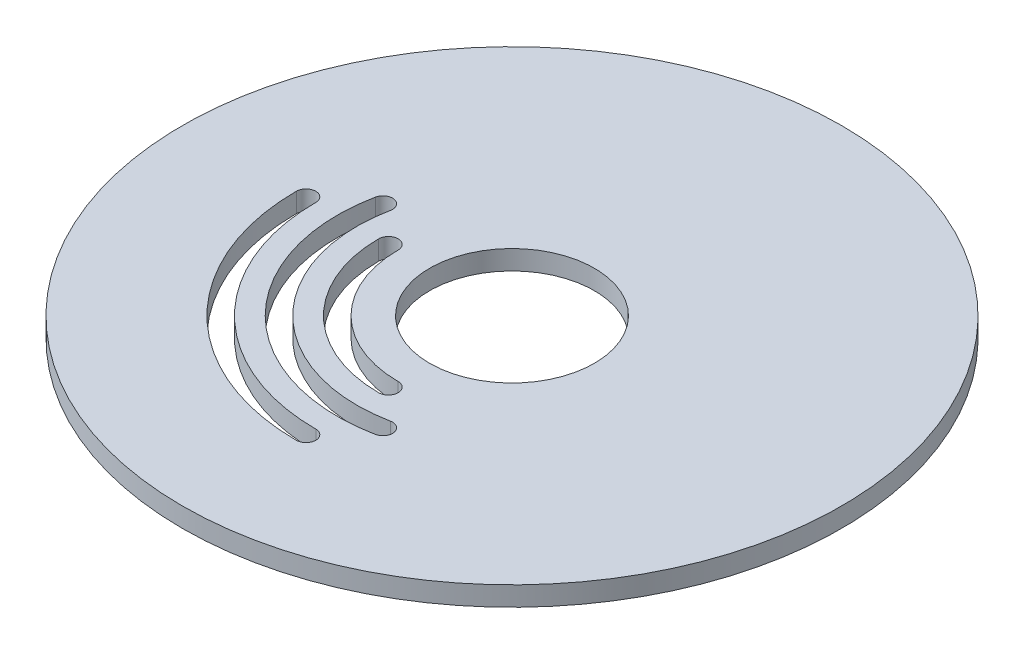
ISO-10303-21;
HEADER;
FILE_DESCRIPTION(('STEP AP214'),'2;1');
FILE_NAME('part.step','',(''),(''),'','','');
FILE_SCHEMA(('AUTOMOTIVE_DESIGN { 1 0 10303 214 1 1 1 1 }'));
ENDSEC;
DATA;
#1=APPLICATION_CONTEXT('core data for automotive mechanical design processes');
#2=APPLICATION_PROTOCOL_DEFINITION('international standard','automotive_design',2000,#1);
#3=PRODUCT_CONTEXT('',#1,'mechanical');
#4=PRODUCT('Part','Part','',(#3));
#5=PRODUCT_RELATED_PRODUCT_CATEGORY('part','',(#4));
#6=PRODUCT_DEFINITION_FORMATION('','',#4);
#7=PRODUCT_DEFINITION_CONTEXT('part definition',#1,'design');
#8=PRODUCT_DEFINITION('design','',#6,#7);
#9=PRODUCT_DEFINITION_SHAPE('','',#8);
#10=(LENGTH_UNIT() NAMED_UNIT(*) SI_UNIT(.MILLI.,.METRE.));
#11=(NAMED_UNIT(*) PLANE_ANGLE_UNIT() SI_UNIT($,.RADIAN.));
#12=(NAMED_UNIT(*) SI_UNIT($,.STERADIAN.) SOLID_ANGLE_UNIT());
#13=UNCERTAINTY_MEASURE_WITH_UNIT(LENGTH_MEASURE(1.E-05),#10,'distance_accuracy_value','');
#14=(GEOMETRIC_REPRESENTATION_CONTEXT(3) GLOBAL_UNCERTAINTY_ASSIGNED_CONTEXT((#13)) GLOBAL_UNIT_ASSIGNED_CONTEXT((#10,
#11,#12)) REPRESENTATION_CONTEXT('',''));
#15=CARTESIAN_POINT('',(0.,0.,0.));
#16=DIRECTION('',(0.,0.,1.));
#17=DIRECTION('',(1.,0.,0.));
#18=AXIS2_PLACEMENT_3D('',#15,#16,#17);
#19=CARTESIAN_POINT('',(0.,3.,0.));
#20=DIRECTION('',(0.,1.,0.));
#21=DIRECTION('',(0.,0.,1.));
#22=AXIS2_PLACEMENT_3D('',#19,#20,#21);
#23=PLANE('',#22);
#24=CARTESIAN_POINT('',(0.,3.,0.));
#25=DIRECTION('',(0.,1.,0.));
#26=DIRECTION('',(0.,0.,1.));
#27=AXIS2_PLACEMENT_3D('',#24,#25,#26);
#28=CIRCLE('',#27,50.8);
#29=CARTESIAN_POINT('',(0.,3.,50.8));
#30=VERTEX_POINT('',#29);
#31=EDGE_CURVE('E11',#30,#30,#28,.T.);
#32=ORIENTED_EDGE('',*,*,#31,.T.);
#33=EDGE_LOOP('',(#32));
#34=FACE_BOUND('',#33,.T.);
#35=CARTESIAN_POINT('',(0.,3.,0.));
#36=DIRECTION('',(0.,1.,0.));
#37=DIRECTION('',(0.,0.,1.));
#38=AXIS2_PLACEMENT_3D('',#35,#36,#37);
#39=CIRCLE('',#38,12.7);
#40=CARTESIAN_POINT('',(0.,3.,12.7));
#41=VERTEX_POINT('',#40);
#42=EDGE_CURVE('E269',#41,#41,#39,.T.);
#43=ORIENTED_EDGE('',*,*,#42,.F.);
#44=EDGE_LOOP('',(#43));
#45=FACE_BOUND('',#44,.T.);
#46=CARTESIAN_POINT('',(0.,3.,0.));
#47=DIRECTION('',(0.,1.,0.));
#48=DIRECTION('',(0.,0.,1.));
#49=AXIS2_PLACEMENT_3D('',#46,#47,#48);
#50=CIRCLE('',#49,33.25);
#51=CARTESIAN_POINT('',(-33.25,3.,0.));
#52=VERTEX_POINT('',#51);
#53=CARTESIAN_POINT('',(0.,3.,33.25));
#54=VERTEX_POINT('',#53);
#55=EDGE_CURVE('E229',#52,#54,#50,.T.);
#56=ORIENTED_EDGE('',*,*,#55,.F.);
#57=CARTESIAN_POINT('',(-31.75,3.,0.));
#58=DIRECTION('',(0.,1.,0.));
#59=DIRECTION('',(0.,0.,1.));
#60=AXIS2_PLACEMENT_3D('',#57,#58,#59);
#61=CIRCLE('',#60,1.5);
#62=CARTESIAN_POINT('',(-30.25,3.,0.));
#63=VERTEX_POINT('',#62);
#64=EDGE_CURVE('E226',#63,#52,#61,.T.);
#65=ORIENTED_EDGE('',*,*,#64,.F.);
#66=CARTESIAN_POINT('',(0.,3.,0.));
#67=DIRECTION('',(0.,-1.,0.));
#68=DIRECTION('',(0.,0.,1.));
#69=AXIS2_PLACEMENT_3D('',#66,#67,#68);
#70=CIRCLE('',#69,30.25);
#71=CARTESIAN_POINT('',(0.,3.,30.25));
#72=VERTEX_POINT('',#71);
#73=EDGE_CURVE('E237',#72,#63,#70,.T.);
#74=ORIENTED_EDGE('',*,*,#73,.F.);
#75=CARTESIAN_POINT('',(0.,3.,31.75));
#76=DIRECTION('',(0.,1.,0.));
#77=DIRECTION('',(0.,0.,1.));
#78=AXIS2_PLACEMENT_3D('',#75,#76,#77);
#79=CIRCLE('',#78,1.5);
#80=EDGE_CURVE('E233',#54,#72,#79,.T.);
#81=ORIENTED_EDGE('',*,*,#80,.F.);
#82=EDGE_LOOP('',(#56,#65,#74,#81));
#83=FACE_BOUND('',#82,.T.);
#84=CARTESIAN_POINT('',(0.,3.,0.));
#85=DIRECTION('',(0.,1.,0.));
#86=DIRECTION('',(0.,0.,1.));
#87=AXIS2_PLACEMENT_3D('',#84,#85,#86);
#88=CIRCLE('',#87,26.9);
#89=CARTESIAN_POINT('',(-26.3736621730869,3.,-5.29527559055118));
#90=VERTEX_POINT('',#89);
#91=CARTESIAN_POINT('',(5.29527559055117,3.,26.3736621730869));
#92=VERTEX_POINT('',#91);
#93=EDGE_CURVE('E186',#90,#92,#88,.T.);
#94=ORIENTED_EDGE('',*,*,#93,.F.);
#95=CARTESIAN_POINT('',(-24.9030118660374,3.,-5.));
#96=DIRECTION('',(0.,1.,0.));
#97=DIRECTION('',(0.,0.,1.));
#98=AXIS2_PLACEMENT_3D('',#95,#96,#97);
#99=CIRCLE('',#98,1.5);
#100=CARTESIAN_POINT('',(-23.432361558988,3.,-4.70472440944882));
#101=VERTEX_POINT('',#100);
#102=EDGE_CURVE('E183',#101,#90,#99,.T.);
#103=ORIENTED_EDGE('',*,*,#102,.F.);
#104=CARTESIAN_POINT('',(0.,3.,0.));
#105=DIRECTION('',(0.,-1.,0.));
#106=DIRECTION('',(0.,0.,1.));
#107=AXIS2_PLACEMENT_3D('',#104,#105,#106);
#108=CIRCLE('',#107,23.9);
#109=CARTESIAN_POINT('',(4.70472440944881,3.,23.432361558988));
#110=VERTEX_POINT('',#109);
#111=EDGE_CURVE('E194',#110,#101,#108,.T.);
#112=ORIENTED_EDGE('',*,*,#111,.F.);
#113=CARTESIAN_POINT('',(5.,3.,24.9030118660374));
#114=DIRECTION('',(0.,1.,0.));
#115=DIRECTION('',(0.,0.,1.));
#116=AXIS2_PLACEMENT_3D('',#113,#114,#115);
#117=CIRCLE('',#116,1.5);
#118=EDGE_CURVE('E190',#92,#110,#117,.T.);
#119=ORIENTED_EDGE('',*,*,#118,.F.);
#120=EDGE_LOOP('',(#94,#103,#112,#119));
#121=FACE_BOUND('',#120,.T.);
#122=CARTESIAN_POINT('',(0.,3.,0.));
#123=DIRECTION('',(0.,1.,0.));
#124=DIRECTION('',(0.,0.,1.));
#125=AXIS2_PLACEMENT_3D('',#122,#123,#124);
#126=CIRCLE('',#125,20.55);
#127=CARTESIAN_POINT('',(-20.55,3.,0.));
#128=VERTEX_POINT('',#127);
#129=CARTESIAN_POINT('',(0.,3.,20.55));
#130=VERTEX_POINT('',#129);
#131=EDGE_CURVE('E144',#128,#130,#126,.T.);
#132=ORIENTED_EDGE('',*,*,#131,.F.);
#133=CARTESIAN_POINT('',(-19.05,3.,0.));
#134=DIRECTION('',(0.,1.,0.));
#135=DIRECTION('',(0.,0.,1.));
#136=AXIS2_PLACEMENT_3D('',#133,#134,#135);
#137=CIRCLE('',#136,1.5);
#138=CARTESIAN_POINT('',(-17.55,3.,0.));
#139=VERTEX_POINT('',#138);
#140=EDGE_CURVE('E135',#139,#128,#137,.T.);
#141=ORIENTED_EDGE('',*,*,#140,.F.);
#142=CARTESIAN_POINT('',(0.,3.,0.));
#143=DIRECTION('',(0.,-1.,0.));
#144=DIRECTION('',(0.,0.,1.));
#145=AXIS2_PLACEMENT_3D('',#142,#143,#144);
#146=CIRCLE('',#145,17.55);
#147=CARTESIAN_POINT('',(0.,3.,17.55));
#148=VERTEX_POINT('',#147);
#149=EDGE_CURVE('E161',#148,#139,#146,.T.);
#150=ORIENTED_EDGE('',*,*,#149,.F.);
#151=CARTESIAN_POINT('',(0.,3.,19.05));
#152=DIRECTION('',(0.,1.,0.));
#153=DIRECTION('',(0.,0.,1.));
#154=AXIS2_PLACEMENT_3D('',#151,#152,#153);
#155=CIRCLE('',#154,1.5);
#156=EDGE_CURVE('E157',#130,#148,#155,.T.);
#157=ORIENTED_EDGE('',*,*,#156,.F.);
#158=EDGE_LOOP('',(#132,#141,#150,#157));
#159=FACE_BOUND('',#158,.T.);
#160=ADVANCED_FACE('F45',(#34,#45,#83,#121,#159),#23,.T.);
#161=CARTESIAN_POINT('',(0.,0.,0.));
#162=DIRECTION('',(0.,1.,0.));
#163=DIRECTION('',(0.,0.,1.));
#164=AXIS2_PLACEMENT_3D('',#161,#162,#163);
#165=PLANE('',#164);
#166=CARTESIAN_POINT('',(-24.9030118660374,0.,-5.));
#167=DIRECTION('',(0.,1.,0.));
#168=DIRECTION('',(0.,0.,1.));
#169=AXIS2_PLACEMENT_3D('',#166,#167,#168);
#170=CIRCLE('',#169,1.5);
#171=CARTESIAN_POINT('',(-23.432361558988,0.,-4.70472440944882));
#172=VERTEX_POINT('',#171);
#173=CARTESIAN_POINT('',(-26.3736621730869,0.,-5.29527559055118));
#174=VERTEX_POINT('',#173);
#175=EDGE_CURVE('E153',#172,#174,#170,.T.);
#176=ORIENTED_EDGE('',*,*,#175,.T.);
#177=CARTESIAN_POINT('',(0.,0.,0.));
#178=DIRECTION('',(0.,1.,0.));
#179=DIRECTION('',(0.,0.,1.));
#180=AXIS2_PLACEMENT_3D('',#177,#178,#179);
#181=CIRCLE('',#180,26.9);
#182=CARTESIAN_POINT('',(5.29527559055117,0.,26.3736621730869));
#183=VERTEX_POINT('',#182);
#184=EDGE_CURVE('E201',#174,#183,#181,.T.);
#185=ORIENTED_EDGE('',*,*,#184,.T.);
#186=CARTESIAN_POINT('',(5.,0.,24.9030118660374));
#187=DIRECTION('',(0.,1.,0.));
#188=DIRECTION('',(0.,0.,1.));
#189=AXIS2_PLACEMENT_3D('',#186,#187,#188);
#190=CIRCLE('',#189,1.5);
#191=CARTESIAN_POINT('',(4.70472440944881,0.,23.432361558988));
#192=VERTEX_POINT('',#191);
#193=EDGE_CURVE('E205',#183,#192,#190,.T.);
#194=ORIENTED_EDGE('',*,*,#193,.T.);
#195=CARTESIAN_POINT('',(0.,0.,0.));
#196=DIRECTION('',(0.,-1.,0.));
#197=DIRECTION('',(0.,0.,1.));
#198=AXIS2_PLACEMENT_3D('',#195,#196,#197);
#199=CIRCLE('',#198,23.9);
#200=EDGE_CURVE('E187',#192,#172,#199,.T.);
#201=ORIENTED_EDGE('',*,*,#200,.T.);
#202=EDGE_LOOP('',(#176,#185,#194,#201));
#203=FACE_BOUND('',#202,.T.);
#204=CARTESIAN_POINT('',(0.,0.,0.));
#205=DIRECTION('',(0.,1.,0.));
#206=DIRECTION('',(0.,0.,1.));
#207=AXIS2_PLACEMENT_3D('',#204,#205,#206);
#208=CIRCLE('',#207,12.7);
#209=CARTESIAN_POINT('',(0.,0.,12.7));
#210=VERTEX_POINT('',#209);
#211=EDGE_CURVE('E268',#210,#210,#208,.T.);
#212=ORIENTED_EDGE('',*,*,#211,.T.);
#213=EDGE_LOOP('',(#212));
#214=FACE_BOUND('',#213,.T.);
#215=CARTESIAN_POINT('',(0.,0.,0.));
#216=DIRECTION('',(0.,1.,0.));
#217=DIRECTION('',(0.,0.,1.));
#218=AXIS2_PLACEMENT_3D('',#215,#216,#217);
#219=CIRCLE('',#218,50.8);
#220=CARTESIAN_POINT('',(0.,0.,50.8));
#221=VERTEX_POINT('',#220);
#222=EDGE_CURVE('E49',#221,#221,#219,.T.);
#223=ORIENTED_EDGE('',*,*,#222,.F.);
#224=EDGE_LOOP('',(#223));
#225=FACE_BOUND('',#224,.T.);
#226=CARTESIAN_POINT('',(-31.75,0.,0.));
#227=DIRECTION('',(0.,1.,0.));
#228=DIRECTION('',(0.,0.,1.));
#229=AXIS2_PLACEMENT_3D('',#226,#227,#228);
#230=CIRCLE('',#229,1.5);
#231=CARTESIAN_POINT('',(-30.25,0.,0.));
#232=VERTEX_POINT('',#231);
#233=CARTESIAN_POINT('',(-33.25,0.,0.));
#234=VERTEX_POINT('',#233);
#235=EDGE_CURVE('E225',#232,#234,#230,.T.);
#236=ORIENTED_EDGE('',*,*,#235,.T.);
#237=CARTESIAN_POINT('',(0.,0.,0.));
#238=DIRECTION('',(0.,1.,0.));
#239=DIRECTION('',(0.,0.,1.));
#240=AXIS2_PLACEMENT_3D('',#237,#238,#239);
#241=CIRCLE('',#240,33.25);
#242=CARTESIAN_POINT('',(0.,0.,33.25));
#243=VERTEX_POINT('',#242);
#244=EDGE_CURVE('E244',#234,#243,#241,.T.);
#245=ORIENTED_EDGE('',*,*,#244,.T.);
#246=CARTESIAN_POINT('',(0.,0.,31.75));
#247=DIRECTION('',(0.,1.,0.));
#248=DIRECTION('',(0.,0.,1.));
#249=AXIS2_PLACEMENT_3D('',#246,#247,#248);
#250=CIRCLE('',#249,1.5);
#251=CARTESIAN_POINT('',(0.,0.,30.25));
#252=VERTEX_POINT('',#251);
#253=EDGE_CURVE('E248',#243,#252,#250,.T.);
#254=ORIENTED_EDGE('',*,*,#253,.T.);
#255=CARTESIAN_POINT('',(0.,0.,0.));
#256=DIRECTION('',(0.,-1.,0.));
#257=DIRECTION('',(0.,0.,1.));
#258=AXIS2_PLACEMENT_3D('',#255,#256,#257);
#259=CIRCLE('',#258,30.25);
#260=EDGE_CURVE('E230',#252,#232,#259,.T.);
#261=ORIENTED_EDGE('',*,*,#260,.T.);
#262=EDGE_LOOP('',(#236,#245,#254,#261));
#263=FACE_BOUND('',#262,.T.);
#264=CARTESIAN_POINT('',(-19.05,0.,0.));
#265=DIRECTION('',(0.,1.,0.));
#266=DIRECTION('',(0.,0.,1.));
#267=AXIS2_PLACEMENT_3D('',#264,#265,#266);
#268=CIRCLE('',#267,1.5);
#269=CARTESIAN_POINT('',(-17.55,0.,0.));
#270=VERTEX_POINT('',#269);
#271=CARTESIAN_POINT('',(-20.55,0.,0.));
#272=VERTEX_POINT('',#271);
#273=EDGE_CURVE('E69',#270,#272,#268,.T.);
#274=ORIENTED_EDGE('',*,*,#273,.T.);
#275=CARTESIAN_POINT('',(0.,0.,0.));
#276=DIRECTION('',(0.,1.,0.));
#277=DIRECTION('',(0.,0.,1.));
#278=AXIS2_PLACEMENT_3D('',#275,#276,#277);
#279=CIRCLE('',#278,20.55);
#280=CARTESIAN_POINT('',(0.,0.,20.55));
#281=VERTEX_POINT('',#280);
#282=EDGE_CURVE('E151',#272,#281,#279,.T.);
#283=ORIENTED_EDGE('',*,*,#282,.T.);
#284=CARTESIAN_POINT('',(0.,0.,19.05));
#285=DIRECTION('',(0.,1.,0.));
#286=DIRECTION('',(0.,0.,1.));
#287=AXIS2_PLACEMENT_3D('',#284,#285,#286);
#288=CIRCLE('',#287,1.5);
#289=CARTESIAN_POINT('',(0.,0.,17.55));
#290=VERTEX_POINT('',#289);
#291=EDGE_CURVE('E170',#281,#290,#288,.T.);
#292=ORIENTED_EDGE('',*,*,#291,.T.);
#293=CARTESIAN_POINT('',(0.,0.,0.));
#294=DIRECTION('',(0.,-1.,0.));
#295=DIRECTION('',(0.,0.,1.));
#296=AXIS2_PLACEMENT_3D('',#293,#294,#295);
#297=CIRCLE('',#296,17.55);
#298=EDGE_CURVE('E145',#290,#270,#297,.T.);
#299=ORIENTED_EDGE('',*,*,#298,.T.);
#300=EDGE_LOOP('',(#274,#283,#292,#299));
#301=FACE_BOUND('',#300,.T.);
#302=ADVANCED_FACE('F277',(#203,#214,#225,#263,#301),#165,.F.);
#303=CARTESIAN_POINT('',(0.,3.,0.));
#304=DIRECTION('',(0.,-1.,0.));
#305=DIRECTION('',(0.,0.,-1.));
#306=AXIS2_PLACEMENT_3D('',#303,#304,#305);
#307=CYLINDRICAL_SURFACE('',#306,50.8);
#308=ORIENTED_EDGE('',*,*,#31,.F.);
#309=EDGE_LOOP('',(#308));
#310=FACE_BOUND('',#309,.T.);
#311=ORIENTED_EDGE('',*,*,#222,.T.);
#312=EDGE_LOOP('',(#311));
#313=FACE_BOUND('',#312,.T.);
#314=ADVANCED_FACE('F47',(#310,#313),#307,.T.);
#315=CARTESIAN_POINT('',(0.,3.,0.));
#316=DIRECTION('',(0.,-1.,0.));
#317=DIRECTION('',(0.,0.,-1.));
#318=AXIS2_PLACEMENT_3D('',#315,#316,#317);
#319=CYLINDRICAL_SURFACE('',#318,12.7);
#320=ORIENTED_EDGE('',*,*,#42,.T.);
#321=EDGE_LOOP('',(#320));
#322=FACE_BOUND('',#321,.T.);
#323=ORIENTED_EDGE('',*,*,#211,.F.);
#324=EDGE_LOOP('',(#323));
#325=FACE_BOUND('',#324,.T.);
#326=ADVANCED_FACE('F280',(#322,#325),#319,.F.);
#327=CARTESIAN_POINT('',(-31.75,3.,0.));
#328=DIRECTION('',(0.,-1.,0.));
#329=DIRECTION('',(0.,0.,-1.));
#330=AXIS2_PLACEMENT_3D('',#327,#328,#329);
#331=CYLINDRICAL_SURFACE('',#330,1.5);
#332=ORIENTED_EDGE('',*,*,#235,.F.);
#333=DIRECTION('',(0.,-1.,0.));
#334=VECTOR('',#333,1.);
#335=CARTESIAN_POINT('',(-30.25,3.,0.));
#336=LINE('',#335,#334);
#337=EDGE_CURVE('E240',#63,#232,#336,.T.);
#338=ORIENTED_EDGE('',*,*,#337,.F.);
#339=ORIENTED_EDGE('',*,*,#64,.T.);
#340=DIRECTION('',(0.,-1.,0.));
#341=VECTOR('',#340,1.);
#342=CARTESIAN_POINT('',(-33.25,3.,0.));
#343=LINE('',#342,#341);
#344=EDGE_CURVE('E264',#52,#234,#343,.T.);
#345=ORIENTED_EDGE('',*,*,#344,.T.);
#346=EDGE_LOOP('',(#332,#338,#339,#345));
#347=FACE_BOUND('',#346,.T.);
#348=ADVANCED_FACE('F282',(#347),#331,.F.);
#349=CARTESIAN_POINT('',(0.,3.,0.));
#350=DIRECTION('',(0.,-1.,0.));
#351=DIRECTION('',(0.,0.,-1.));
#352=AXIS2_PLACEMENT_3D('',#349,#350,#351);
#353=CYLINDRICAL_SURFACE('',#352,33.25);
#354=ORIENTED_EDGE('',*,*,#244,.F.);
#355=ORIENTED_EDGE('',*,*,#344,.F.);
#356=ORIENTED_EDGE('',*,*,#55,.T.);
#357=DIRECTION('',(0.,-1.,0.));
#358=VECTOR('',#357,1.);
#359=CARTESIAN_POINT('',(0.,3.,33.25));
#360=LINE('',#359,#358);
#361=EDGE_CURVE('E261',#54,#243,#360,.T.);
#362=ORIENTED_EDGE('',*,*,#361,.T.);
#363=EDGE_LOOP('',(#354,#355,#356,#362));
#364=FACE_BOUND('',#363,.T.);
#365=ADVANCED_FACE('F289',(#364),#353,.F.);
#366=CARTESIAN_POINT('',(0.,3.,31.75));
#367=DIRECTION('',(0.,-1.,0.));
#368=DIRECTION('',(0.,0.,-1.));
#369=AXIS2_PLACEMENT_3D('',#366,#367,#368);
#370=CYLINDRICAL_SURFACE('',#369,1.5);
#371=ORIENTED_EDGE('',*,*,#253,.F.);
#372=ORIENTED_EDGE('',*,*,#361,.F.);
#373=ORIENTED_EDGE('',*,*,#80,.T.);
#374=DIRECTION('',(0.,-1.,0.));
#375=VECTOR('',#374,1.);
#376=CARTESIAN_POINT('',(0.,3.,30.25));
#377=LINE('',#376,#375);
#378=EDGE_CURVE('E258',#72,#252,#377,.T.);
#379=ORIENTED_EDGE('',*,*,#378,.T.);
#380=EDGE_LOOP('',(#371,#372,#373,#379));
#381=FACE_BOUND('',#380,.T.);
#382=ADVANCED_FACE('F342',(#381),#370,.F.);
#383=CARTESIAN_POINT('',(0.,3.,0.));
#384=DIRECTION('',(0.,-1.,0.));
#385=DIRECTION('',(0.,0.,-1.));
#386=AXIS2_PLACEMENT_3D('',#383,#384,#385);
#387=CYLINDRICAL_SURFACE('',#386,30.25);
#388=ORIENTED_EDGE('',*,*,#260,.F.);
#389=ORIENTED_EDGE('',*,*,#378,.F.);
#390=ORIENTED_EDGE('',*,*,#73,.T.);
#391=ORIENTED_EDGE('',*,*,#337,.T.);
#392=EDGE_LOOP('',(#388,#389,#390,#391));
#393=FACE_BOUND('',#392,.T.);
#394=ADVANCED_FACE('F339',(#393),#387,.T.);
#395=CARTESIAN_POINT('',(-24.9030118660374,3.,-5.));
#396=DIRECTION('',(0.,-1.,0.));
#397=DIRECTION('',(0.,0.,-1.));
#398=AXIS2_PLACEMENT_3D('',#395,#396,#397);
#399=CYLINDRICAL_SURFACE('',#398,1.5);
#400=ORIENTED_EDGE('',*,*,#175,.F.);
#401=DIRECTION('',(0.,-1.,0.));
#402=VECTOR('',#401,1.);
#403=CARTESIAN_POINT('',(-23.432361558988,3.,-4.70472440944882));
#404=LINE('',#403,#402);
#405=EDGE_CURVE('E197',#101,#172,#404,.T.);
#406=ORIENTED_EDGE('',*,*,#405,.F.);
#407=ORIENTED_EDGE('',*,*,#102,.T.);
#408=DIRECTION('',(0.,-1.,0.));
#409=VECTOR('',#408,1.);
#410=CARTESIAN_POINT('',(-26.3736621730869,3.,-5.29527559055118));
#411=LINE('',#410,#409);
#412=EDGE_CURVE('E221',#90,#174,#411,.T.);
#413=ORIENTED_EDGE('',*,*,#412,.T.);
#414=EDGE_LOOP('',(#400,#406,#407,#413));
#415=FACE_BOUND('',#414,.T.);
#416=ADVANCED_FACE('F321',(#415),#399,.F.);
#417=CARTESIAN_POINT('',(0.,3.,0.));
#418=DIRECTION('',(0.,-1.,0.));
#419=DIRECTION('',(0.,0.,-1.));
#420=AXIS2_PLACEMENT_3D('',#417,#418,#419);
#421=CYLINDRICAL_SURFACE('',#420,26.9);
#422=ORIENTED_EDGE('',*,*,#184,.F.);
#423=ORIENTED_EDGE('',*,*,#412,.F.);
#424=ORIENTED_EDGE('',*,*,#93,.T.);
#425=DIRECTION('',(0.,-1.,0.));
#426=VECTOR('',#425,1.);
#427=CARTESIAN_POINT('',(5.29527559055117,3.,26.3736621730869));
#428=LINE('',#427,#426);
#429=EDGE_CURVE('E218',#92,#183,#428,.T.);
#430=ORIENTED_EDGE('',*,*,#429,.T.);
#431=EDGE_LOOP('',(#422,#423,#424,#430));
#432=FACE_BOUND('',#431,.T.);
#433=ADVANCED_FACE('F315',(#432),#421,.F.);
#434=CARTESIAN_POINT('',(5.,3.,24.9030118660374));
#435=DIRECTION('',(0.,-1.,0.));
#436=DIRECTION('',(0.,0.,-1.));
#437=AXIS2_PLACEMENT_3D('',#434,#435,#436);
#438=CYLINDRICAL_SURFACE('',#437,1.5);
#439=ORIENTED_EDGE('',*,*,#193,.F.);
#440=ORIENTED_EDGE('',*,*,#429,.F.);
#441=ORIENTED_EDGE('',*,*,#118,.T.);
#442=DIRECTION('',(0.,-1.,0.));
#443=VECTOR('',#442,1.);
#444=CARTESIAN_POINT('',(4.70472440944881,3.,23.432361558988));
#445=LINE('',#444,#443);
#446=EDGE_CURVE('E215',#110,#192,#445,.T.);
#447=ORIENTED_EDGE('',*,*,#446,.T.);
#448=EDGE_LOOP('',(#439,#440,#441,#447));
#449=FACE_BOUND('',#448,.T.);
#450=ADVANCED_FACE('F318',(#449),#438,.F.);
#451=CARTESIAN_POINT('',(0.,3.,0.));
#452=DIRECTION('',(0.,-1.,0.));
#453=DIRECTION('',(0.,0.,-1.));
#454=AXIS2_PLACEMENT_3D('',#451,#452,#453);
#455=CYLINDRICAL_SURFACE('',#454,23.9);
#456=ORIENTED_EDGE('',*,*,#200,.F.);
#457=ORIENTED_EDGE('',*,*,#446,.F.);
#458=ORIENTED_EDGE('',*,*,#111,.T.);
#459=ORIENTED_EDGE('',*,*,#405,.T.);
#460=EDGE_LOOP('',(#456,#457,#458,#459));
#461=FACE_BOUND('',#460,.T.);
#462=ADVANCED_FACE('F324',(#461),#455,.T.);
#463=CARTESIAN_POINT('',(-19.05,3.,0.));
#464=DIRECTION('',(0.,-1.,0.));
#465=DIRECTION('',(0.,0.,-1.));
#466=AXIS2_PLACEMENT_3D('',#463,#464,#465);
#467=CYLINDRICAL_SURFACE('',#466,1.5);
#468=ORIENTED_EDGE('',*,*,#273,.F.);
#469=DIRECTION('',(0.,-1.,0.));
#470=VECTOR('',#469,1.);
#471=CARTESIAN_POINT('',(-17.55,3.,0.));
#472=LINE('',#471,#470);
#473=EDGE_CURVE('E139',#139,#270,#472,.T.);
#474=ORIENTED_EDGE('',*,*,#473,.F.);
#475=ORIENTED_EDGE('',*,*,#140,.T.);
#476=DIRECTION('',(0.,-1.,0.));
#477=VECTOR('',#476,1.);
#478=CARTESIAN_POINT('',(-20.55,3.,0.));
#479=LINE('',#478,#477);
#480=EDGE_CURVE('E138',#128,#272,#479,.T.);
#481=ORIENTED_EDGE('',*,*,#480,.T.);
#482=EDGE_LOOP('',(#468,#474,#475,#481));
#483=FACE_BOUND('',#482,.T.);
#484=ADVANCED_FACE('F137',(#483),#467,.F.);
#485=CARTESIAN_POINT('',(0.,3.,0.));
#486=DIRECTION('',(0.,-1.,0.));
#487=DIRECTION('',(0.,0.,-1.));
#488=AXIS2_PLACEMENT_3D('',#485,#486,#487);
#489=CYLINDRICAL_SURFACE('',#488,20.55);
#490=ORIENTED_EDGE('',*,*,#282,.F.);
#491=ORIENTED_EDGE('',*,*,#480,.F.);
#492=ORIENTED_EDGE('',*,*,#131,.T.);
#493=DIRECTION('',(0.,-1.,0.));
#494=VECTOR('',#493,1.);
#495=CARTESIAN_POINT('',(0.,3.,20.55));
#496=LINE('',#495,#494);
#497=EDGE_CURVE('E154',#130,#281,#496,.T.);
#498=ORIENTED_EDGE('',*,*,#497,.T.);
#499=EDGE_LOOP('',(#490,#491,#492,#498));
#500=FACE_BOUND('',#499,.T.);
#501=ADVANCED_FACE('F148',(#500),#489,.F.);
#502=CARTESIAN_POINT('',(0.,3.,19.05));
#503=DIRECTION('',(0.,-1.,0.));
#504=DIRECTION('',(0.,0.,-1.));
#505=AXIS2_PLACEMENT_3D('',#502,#503,#504);
#506=CYLINDRICAL_SURFACE('',#505,1.5);
#507=ORIENTED_EDGE('',*,*,#291,.F.);
#508=ORIENTED_EDGE('',*,*,#497,.F.);
#509=ORIENTED_EDGE('',*,*,#156,.T.);
#510=DIRECTION('',(0.,-1.,0.));
#511=VECTOR('',#510,1.);
#512=CARTESIAN_POINT('',(0.,3.,17.55));
#513=LINE('',#512,#511);
#514=EDGE_CURVE('E61',#148,#290,#513,.T.);
#515=ORIENTED_EDGE('',*,*,#514,.T.);
#516=EDGE_LOOP('',(#507,#508,#509,#515));
#517=FACE_BOUND('',#516,.T.);
#518=ADVANCED_FACE('F362',(#517),#506,.F.);
#519=CARTESIAN_POINT('',(0.,3.,0.));
#520=DIRECTION('',(0.,-1.,0.));
#521=DIRECTION('',(0.,0.,-1.));
#522=AXIS2_PLACEMENT_3D('',#519,#520,#521);
#523=CYLINDRICAL_SURFACE('',#522,17.55);
#524=ORIENTED_EDGE('',*,*,#298,.F.);
#525=ORIENTED_EDGE('',*,*,#514,.F.);
#526=ORIENTED_EDGE('',*,*,#149,.T.);
#527=ORIENTED_EDGE('',*,*,#473,.T.);
#528=EDGE_LOOP('',(#524,#525,#526,#527));
#529=FACE_BOUND('',#528,.T.);
#530=ADVANCED_FACE('F360',(#529),#523,.T.);
#531=CLOSED_SHELL('',(#160,#302,#314,#326,#348,#365,#382,#394,#416,#433,#450,#462,#484,#501,
#518,#530));
#532=MANIFOLD_SOLID_BREP('B2',#531);
#533=ADVANCED_BREP_SHAPE_REPRESENTATION('',(#18,#532),#14);
#534=SHAPE_DEFINITION_REPRESENTATION(#9,#533);
ENDSEC;
END-ISO-10303-21;
